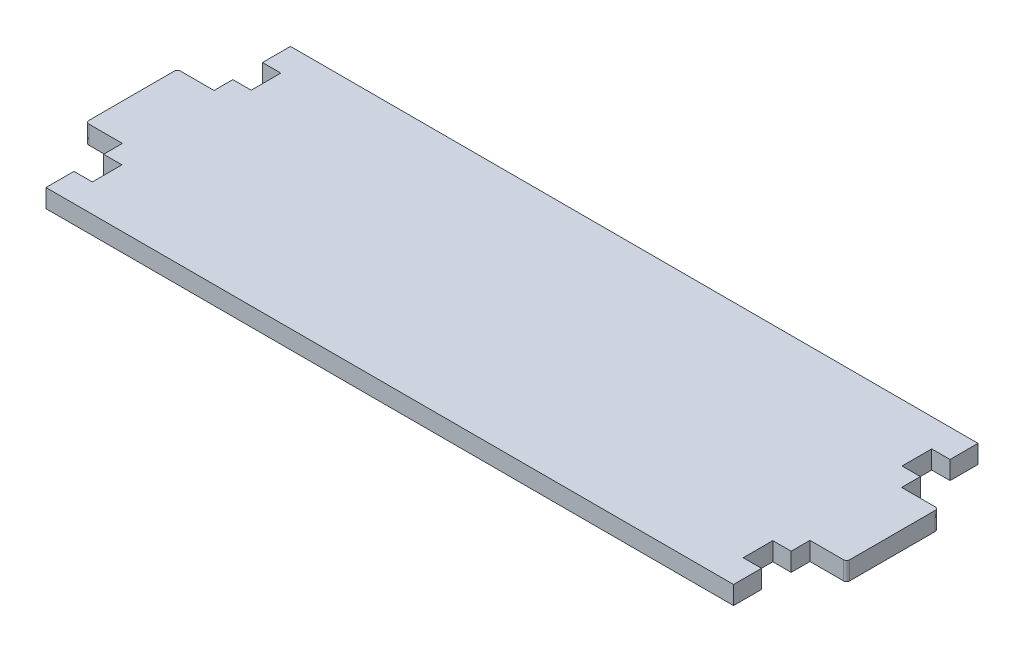
ISO-10303-21;
HEADER;
FILE_DESCRIPTION(('STEP AP214'),'2;1');
FILE_NAME('part.step','',(''),(''),'','','');
FILE_SCHEMA(('AUTOMOTIVE_DESIGN { 1 0 10303 214 1 1 1 1 }'));
ENDSEC;
DATA;
#1=APPLICATION_CONTEXT('core data for automotive mechanical design processes');
#2=APPLICATION_PROTOCOL_DEFINITION('international standard','automotive_design',2000,#1);
#3=PRODUCT_CONTEXT('',#1,'mechanical');
#4=PRODUCT('Part','Part','',(#3));
#5=PRODUCT_RELATED_PRODUCT_CATEGORY('part','',(#4));
#6=PRODUCT_DEFINITION_FORMATION('','',#4);
#7=PRODUCT_DEFINITION_CONTEXT('part definition',#1,'design');
#8=PRODUCT_DEFINITION('design','',#6,#7);
#9=PRODUCT_DEFINITION_SHAPE('','',#8);
#10=(LENGTH_UNIT() NAMED_UNIT(*) SI_UNIT(.MILLI.,.METRE.));
#11=(NAMED_UNIT(*) PLANE_ANGLE_UNIT() SI_UNIT($,.RADIAN.));
#12=(NAMED_UNIT(*) SI_UNIT($,.STERADIAN.) SOLID_ANGLE_UNIT());
#13=UNCERTAINTY_MEASURE_WITH_UNIT(LENGTH_MEASURE(1.E-05),#10,'distance_accuracy_value','');
#14=(GEOMETRIC_REPRESENTATION_CONTEXT(3) GLOBAL_UNCERTAINTY_ASSIGNED_CONTEXT((#13)) GLOBAL_UNIT_ASSIGNED_CONTEXT((#10,
#11,#12)) REPRESENTATION_CONTEXT('',''));
#15=CARTESIAN_POINT('',(0.,0.,0.));
#16=DIRECTION('',(0.,0.,1.));
#17=DIRECTION('',(1.,0.,0.));
#18=AXIS2_PLACEMENT_3D('',#15,#16,#17);
#19=CARTESIAN_POINT('',(0.,3.,10.5750000000001));
#20=DIRECTION('',(0.,0.,1.));
#21=DIRECTION('',(1.,0.,0.));
#22=AXIS2_PLACEMENT_3D('',#19,#20,#21);
#23=PLANE('',#22);
#24=DIRECTION('',(-1.,0.,0.));
#25=VECTOR('',#24,1.);
#26=CARTESIAN_POINT('',(0.,0.,10.5750000000001));
#27=LINE('',#26,#25);
#28=CARTESIAN_POINT('',(-53.25,0.,10.575));
#29=VERTEX_POINT('',#28);
#30=CARTESIAN_POINT('',(-56.25,0.,10.575));
#31=VERTEX_POINT('',#30);
#32=EDGE_CURVE('E260',#29,#31,#27,.T.);
#33=ORIENTED_EDGE('',*,*,#32,.F.);
#34=DIRECTION('',(0.,-1.,0.));
#35=VECTOR('',#34,1.);
#36=CARTESIAN_POINT('',(-53.25,3.,10.575));
#37=LINE('',#36,#35);
#38=CARTESIAN_POINT('',(-53.25,3.,10.575));
#39=VERTEX_POINT('',#38);
#40=EDGE_CURVE('E256',#39,#29,#37,.T.);
#41=ORIENTED_EDGE('',*,*,#40,.F.);
#42=DIRECTION('',(-1.,0.,0.));
#43=VECTOR('',#42,1.);
#44=CARTESIAN_POINT('',(0.,3.,10.5750000000001));
#45=LINE('',#44,#43);
#46=CARTESIAN_POINT('',(-56.25,3.,10.575));
#47=VERTEX_POINT('',#46);
#48=EDGE_CURVE('E258',#39,#47,#45,.T.);
#49=ORIENTED_EDGE('',*,*,#48,.T.);
#50=DIRECTION('',(0.,-1.,0.));
#51=VECTOR('',#50,1.);
#52=CARTESIAN_POINT('',(-56.25,3.,10.575));
#53=LINE('',#52,#51);
#54=EDGE_CURVE('E506',#47,#31,#53,.T.);
#55=ORIENTED_EDGE('',*,*,#54,.T.);
#56=EDGE_LOOP('',(#33,#41,#49,#55));
#57=FACE_BOUND('',#56,.T.);
#58=ADVANCED_FACE('F45',(#57),#23,.T.);
#59=CARTESIAN_POINT('',(-53.25,3.,0.));
#60=DIRECTION('',(-1.,0.,0.));
#61=DIRECTION('',(0.,0.,1.));
#62=AXIS2_PLACEMENT_3D('',#59,#60,#61);
#63=PLANE('',#62);
#64=DIRECTION('',(0.,0.,-1.));
#65=VECTOR('',#64,1.);
#66=CARTESIAN_POINT('',(-53.25,0.,0.));
#67=LINE('',#66,#65);
#68=CARTESIAN_POINT('',(-53.25,0.,15.425));
#69=VERTEX_POINT('',#68);
#70=EDGE_CURVE('E599',#69,#29,#67,.T.);
#71=ORIENTED_EDGE('',*,*,#70,.F.);
#72=DIRECTION('',(0.,-1.,0.));
#73=VECTOR('',#72,1.);
#74=CARTESIAN_POINT('',(-53.25,3.,15.425));
#75=LINE('',#74,#73);
#76=CARTESIAN_POINT('',(-53.25,3.,15.425));
#77=VERTEX_POINT('',#76);
#78=EDGE_CURVE('E266',#77,#69,#75,.T.);
#79=ORIENTED_EDGE('',*,*,#78,.F.);
#80=DIRECTION('',(0.,0.,-1.));
#81=VECTOR('',#80,1.);
#82=CARTESIAN_POINT('',(-53.25,3.,0.));
#83=LINE('',#82,#81);
#84=EDGE_CURVE('E271',#77,#39,#83,.T.);
#85=ORIENTED_EDGE('',*,*,#84,.T.);
#86=ORIENTED_EDGE('',*,*,#40,.T.);
#87=EDGE_LOOP('',(#71,#79,#85,#86));
#88=FACE_BOUND('',#87,.T.);
#89=ADVANCED_FACE('F278',(#88),#63,.T.);
#90=CARTESIAN_POINT('',(0.,3.,15.4250000000001));
#91=DIRECTION('',(0.,0.,1.));
#92=DIRECTION('',(1.,0.,0.));
#93=AXIS2_PLACEMENT_3D('',#90,#91,#92);
#94=PLANE('',#93);
#95=DIRECTION('',(-1.,0.,0.));
#96=VECTOR('',#95,1.);
#97=CARTESIAN_POINT('',(0.,0.,15.4250000000001));
#98=LINE('',#97,#96);
#99=CARTESIAN_POINT('',(-56.25,0.,15.425));
#100=VERTEX_POINT('',#99);
#101=EDGE_CURVE('E595',#69,#100,#98,.T.);
#102=ORIENTED_EDGE('',*,*,#101,.T.);
#103=DIRECTION('',(0.,-1.,0.));
#104=VECTOR('',#103,1.);
#105=CARTESIAN_POINT('',(-56.25,3.,15.425));
#106=LINE('',#105,#104);
#107=CARTESIAN_POINT('',(-56.25,3.,15.425));
#108=VERTEX_POINT('',#107);
#109=EDGE_CURVE('E460',#108,#100,#106,.T.);
#110=ORIENTED_EDGE('',*,*,#109,.F.);
#111=DIRECTION('',(-1.,0.,0.));
#112=VECTOR('',#111,1.);
#113=CARTESIAN_POINT('',(0.,3.,15.4250000000001));
#114=LINE('',#113,#112);
#115=EDGE_CURVE('E281',#77,#108,#114,.T.);
#116=ORIENTED_EDGE('',*,*,#115,.F.);
#117=ORIENTED_EDGE('',*,*,#78,.T.);
#118=EDGE_LOOP('',(#102,#110,#116,#117));
#119=FACE_BOUND('',#118,.T.);
#120=ADVANCED_FACE('F624',(#119),#94,.F.);
#121=CARTESIAN_POINT('',(-56.25,3.,0.));
#122=DIRECTION('',(1.,0.,0.));
#123=DIRECTION('',(0.,0.,-1.));
#124=AXIS2_PLACEMENT_3D('',#121,#122,#123);
#125=PLANE('',#124);
#126=DIRECTION('',(0.,0.,1.));
#127=VECTOR('',#126,1.);
#128=CARTESIAN_POINT('',(-56.25,0.,0.));
#129=LINE('',#128,#127);
#130=CARTESIAN_POINT('',(-56.25,0.,20.));
#131=VERTEX_POINT('',#130);
#132=EDGE_CURVE('E559',#100,#131,#129,.T.);
#133=ORIENTED_EDGE('',*,*,#132,.T.);
#134=DIRECTION('',(0.,-1.,0.));
#135=VECTOR('',#134,1.);
#136=CARTESIAN_POINT('',(-56.25,3.,20.));
#137=LINE('',#136,#135);
#138=CARTESIAN_POINT('',(-56.25,3.,20.));
#139=VERTEX_POINT('',#138);
#140=EDGE_CURVE('E457',#139,#131,#137,.T.);
#141=ORIENTED_EDGE('',*,*,#140,.F.);
#142=DIRECTION('',(0.,0.,1.));
#143=VECTOR('',#142,1.);
#144=CARTESIAN_POINT('',(-56.25,3.,0.));
#145=LINE('',#144,#143);
#146=EDGE_CURVE('E284',#108,#139,#145,.T.);
#147=ORIENTED_EDGE('',*,*,#146,.F.);
#148=ORIENTED_EDGE('',*,*,#109,.T.);
#149=EDGE_LOOP('',(#133,#141,#147,#148));
#150=FACE_BOUND('',#149,.T.);
#151=ADVANCED_FACE('F622',(#150),#125,.F.);
#152=CARTESIAN_POINT('',(0.,3.,20.));
#153=DIRECTION('',(0.,0.,-1.));
#154=DIRECTION('',(-1.,0.,0.));
#155=AXIS2_PLACEMENT_3D('',#152,#153,#154);
#156=PLANE('',#155);
#157=DIRECTION('',(1.,0.,0.));
#158=VECTOR('',#157,1.);
#159=CARTESIAN_POINT('',(0.,0.,20.));
#160=LINE('',#159,#158);
#161=CARTESIAN_POINT('',(56.25,0.,20.));
#162=VERTEX_POINT('',#161);
#163=EDGE_CURVE('E553',#131,#162,#160,.T.);
#164=ORIENTED_EDGE('',*,*,#163,.T.);
#165=DIRECTION('',(0.,-1.,0.));
#166=VECTOR('',#165,1.);
#167=CARTESIAN_POINT('',(56.25,3.,20.));
#168=LINE('',#167,#166);
#169=CARTESIAN_POINT('',(56.25,3.,20.));
#170=VERTEX_POINT('',#169);
#171=EDGE_CURVE('E455',#170,#162,#168,.T.);
#172=ORIENTED_EDGE('',*,*,#171,.F.);
#173=DIRECTION('',(1.,0.,0.));
#174=VECTOR('',#173,1.);
#175=CARTESIAN_POINT('',(0.,3.,20.));
#176=LINE('',#175,#174);
#177=EDGE_CURVE('E299',#139,#170,#176,.T.);
#178=ORIENTED_EDGE('',*,*,#177,.F.);
#179=ORIENTED_EDGE('',*,*,#140,.T.);
#180=EDGE_LOOP('',(#164,#172,#178,#179));
#181=FACE_BOUND('',#180,.T.);
#182=ADVANCED_FACE('F618',(#181),#156,.F.);
#183=CARTESIAN_POINT('',(56.25,3.,0.));
#184=DIRECTION('',(1.,0.,0.));
#185=DIRECTION('',(0.,0.,-1.));
#186=AXIS2_PLACEMENT_3D('',#183,#184,#185);
#187=PLANE('',#186);
#188=DIRECTION('',(0.,0.,1.));
#189=VECTOR('',#188,1.);
#190=CARTESIAN_POINT('',(56.25,0.,0.));
#191=LINE('',#190,#189);
#192=CARTESIAN_POINT('',(56.25,0.,15.425));
#193=VERTEX_POINT('',#192);
#194=EDGE_CURVE('E543',#193,#162,#191,.T.);
#195=ORIENTED_EDGE('',*,*,#194,.F.);
#196=DIRECTION('',(0.,-1.,0.));
#197=VECTOR('',#196,1.);
#198=CARTESIAN_POINT('',(56.25,3.,15.425));
#199=LINE('',#198,#197);
#200=CARTESIAN_POINT('',(56.25,3.,15.425));
#201=VERTEX_POINT('',#200);
#202=EDGE_CURVE('E453',#201,#193,#199,.T.);
#203=ORIENTED_EDGE('',*,*,#202,.F.);
#204=DIRECTION('',(0.,0.,1.));
#205=VECTOR('',#204,1.);
#206=CARTESIAN_POINT('',(56.25,3.,0.));
#207=LINE('',#206,#205);
#208=EDGE_CURVE('E418',#201,#170,#207,.T.);
#209=ORIENTED_EDGE('',*,*,#208,.T.);
#210=ORIENTED_EDGE('',*,*,#171,.T.);
#211=EDGE_LOOP('',(#195,#203,#209,#210));
#212=FACE_BOUND('',#211,.T.);
#213=ADVANCED_FACE('F708',(#212),#187,.T.);
#214=CARTESIAN_POINT('',(0.,3.,15.4250000000002));
#215=DIRECTION('',(0.,0.,-1.));
#216=DIRECTION('',(-1.,0.,0.));
#217=AXIS2_PLACEMENT_3D('',#214,#215,#216);
#218=PLANE('',#217);
#219=DIRECTION('',(1.,0.,0.));
#220=VECTOR('',#219,1.);
#221=CARTESIAN_POINT('',(0.,0.,15.4250000000002));
#222=LINE('',#221,#220);
#223=CARTESIAN_POINT('',(53.25,0.,15.425));
#224=VERTEX_POINT('',#223);
#225=EDGE_CURVE('E552',#224,#193,#222,.T.);
#226=ORIENTED_EDGE('',*,*,#225,.F.);
#227=DIRECTION('',(0.,-1.,0.));
#228=VECTOR('',#227,1.);
#229=CARTESIAN_POINT('',(53.25,3.,15.425));
#230=LINE('',#229,#228);
#231=CARTESIAN_POINT('',(53.25,3.,15.425));
#232=VERTEX_POINT('',#231);
#233=EDGE_CURVE('E451',#232,#224,#230,.T.);
#234=ORIENTED_EDGE('',*,*,#233,.F.);
#235=DIRECTION('',(1.,0.,0.));
#236=VECTOR('',#235,1.);
#237=CARTESIAN_POINT('',(0.,3.,15.4250000000002));
#238=LINE('',#237,#236);
#239=EDGE_CURVE('E671',#232,#201,#238,.T.);
#240=ORIENTED_EDGE('',*,*,#239,.T.);
#241=ORIENTED_EDGE('',*,*,#202,.T.);
#242=EDGE_LOOP('',(#226,#234,#240,#241));
#243=FACE_BOUND('',#242,.T.);
#244=ADVANCED_FACE('F715',(#243),#218,.T.);
#245=CARTESIAN_POINT('',(53.25,3.,0.));
#246=DIRECTION('',(-1.,0.,0.));
#247=DIRECTION('',(0.,0.,1.));
#248=AXIS2_PLACEMENT_3D('',#245,#246,#247);
#249=PLANE('',#248);
#250=DIRECTION('',(0.,0.,-1.));
#251=VECTOR('',#250,1.);
#252=CARTESIAN_POINT('',(53.25,0.,0.));
#253=LINE('',#252,#251);
#254=CARTESIAN_POINT('',(53.25,0.,10.575));
#255=VERTEX_POINT('',#254);
#256=EDGE_CURVE('E557',#224,#255,#253,.T.);
#257=ORIENTED_EDGE('',*,*,#256,.T.);
#258=DIRECTION('',(0.,-1.,0.));
#259=VECTOR('',#258,1.);
#260=CARTESIAN_POINT('',(53.25,3.,10.575));
#261=LINE('',#260,#259);
#262=CARTESIAN_POINT('',(53.25,3.,10.575));
#263=VERTEX_POINT('',#262);
#264=EDGE_CURVE('E448',#263,#255,#261,.T.);
#265=ORIENTED_EDGE('',*,*,#264,.F.);
#266=DIRECTION('',(0.,0.,-1.));
#267=VECTOR('',#266,1.);
#268=CARTESIAN_POINT('',(53.25,3.,0.));
#269=LINE('',#268,#267);
#270=EDGE_CURVE('E668',#232,#263,#269,.T.);
#271=ORIENTED_EDGE('',*,*,#270,.F.);
#272=ORIENTED_EDGE('',*,*,#233,.T.);
#273=EDGE_LOOP('',(#257,#265,#271,#272));
#274=FACE_BOUND('',#273,.T.);
#275=ADVANCED_FACE('F693',(#274),#249,.F.);
#276=CARTESIAN_POINT('',(0.,3.,10.5750000000001));
#277=DIRECTION('',(0.,0.,-1.));
#278=DIRECTION('',(-1.,0.,0.));
#279=AXIS2_PLACEMENT_3D('',#276,#277,#278);
#280=PLANE('',#279);
#281=DIRECTION('',(1.,0.,0.));
#282=VECTOR('',#281,1.);
#283=CARTESIAN_POINT('',(0.,0.,10.5750000000001));
#284=LINE('',#283,#282);
#285=CARTESIAN_POINT('',(56.25,0.,10.575));
#286=VERTEX_POINT('',#285);
#287=EDGE_CURVE('E562',#255,#286,#284,.T.);
#288=ORIENTED_EDGE('',*,*,#287,.T.);
#289=DIRECTION('',(0.,-1.,0.));
#290=VECTOR('',#289,1.);
#291=CARTESIAN_POINT('',(56.25,3.,10.575));
#292=LINE('',#291,#290);
#293=CARTESIAN_POINT('',(56.25,3.,10.575));
#294=VERTEX_POINT('',#293);
#295=EDGE_CURVE('E446',#294,#286,#292,.T.);
#296=ORIENTED_EDGE('',*,*,#295,.F.);
#297=DIRECTION('',(1.,0.,0.));
#298=VECTOR('',#297,1.);
#299=CARTESIAN_POINT('',(0.,3.,10.5750000000001));
#300=LINE('',#299,#298);
#301=EDGE_CURVE('E663',#263,#294,#300,.T.);
#302=ORIENTED_EDGE('',*,*,#301,.F.);
#303=ORIENTED_EDGE('',*,*,#264,.T.);
#304=EDGE_LOOP('',(#288,#296,#302,#303));
#305=FACE_BOUND('',#304,.T.);
#306=ADVANCED_FACE('F695',(#305),#280,.F.);
#307=CARTESIAN_POINT('',(56.25,0.,7.5));
#308=VERTEX_POINT('',#307);
#309=EDGE_CURVE('E550',#308,#286,#191,.T.);
#310=ORIENTED_EDGE('',*,*,#309,.F.);
#311=DIRECTION('',(0.,-1.,0.));
#312=VECTOR('',#311,1.);
#313=CARTESIAN_POINT('',(56.25,3.,7.5));
#314=LINE('',#313,#312);
#315=CARTESIAN_POINT('',(56.25,3.,7.5));
#316=VERTEX_POINT('',#315);
#317=EDGE_CURVE('E444',#316,#308,#314,.T.);
#318=ORIENTED_EDGE('',*,*,#317,.F.);
#319=EDGE_CURVE('E658',#316,#294,#207,.T.);
#320=ORIENTED_EDGE('',*,*,#319,.T.);
#321=ORIENTED_EDGE('',*,*,#295,.T.);
#322=EDGE_LOOP('',(#310,#318,#320,#321));
#323=FACE_BOUND('',#322,.T.);
#324=ADVANCED_FACE('F696',(#323),#187,.T.);
#325=CARTESIAN_POINT('',(0.,3.,7.50000000000001));
#326=DIRECTION('',(0.,0.,-1.));
#327=DIRECTION('',(-1.,0.,0.));
#328=AXIS2_PLACEMENT_3D('',#325,#326,#327);
#329=PLANE('',#328);
#330=DIRECTION('',(1.,0.,0.));
#331=VECTOR('',#330,1.);
#332=CARTESIAN_POINT('',(0.,0.,7.50000000000001));
#333=LINE('',#332,#331);
#334=CARTESIAN_POINT('',(61.75,0.,7.5));
#335=VERTEX_POINT('',#334);
#336=EDGE_CURVE('E561',#308,#335,#333,.T.);
#337=ORIENTED_EDGE('',*,*,#336,.T.);
#338=DIRECTION('',(0.,-1.,0.));
#339=VECTOR('',#338,1.);
#340=CARTESIAN_POINT('',(61.75,3.,7.5));
#341=LINE('',#340,#339);
#342=CARTESIAN_POINT('',(61.75,3.,7.5));
#343=VERTEX_POINT('',#342);
#344=EDGE_CURVE('E12',#335,#343,#341,.F.);
#345=ORIENTED_EDGE('',*,*,#344,.T.);
#346=DIRECTION('',(1.,0.,0.));
#347=VECTOR('',#346,1.);
#348=CARTESIAN_POINT('',(0.,3.,7.50000000000001));
#349=LINE('',#348,#347);
#350=EDGE_CURVE('E373',#316,#343,#349,.T.);
#351=ORIENTED_EDGE('',*,*,#350,.F.);
#352=ORIENTED_EDGE('',*,*,#317,.T.);
#353=EDGE_LOOP('',(#337,#345,#351,#352));
#354=FACE_BOUND('',#353,.T.);
#355=ADVANCED_FACE('F699',(#354),#329,.F.);
#356=CARTESIAN_POINT('',(62.25,3.,0.));
#357=DIRECTION('',(1.,0.,0.));
#358=DIRECTION('',(0.,0.,-1.));
#359=AXIS2_PLACEMENT_3D('',#356,#357,#358);
#360=PLANE('',#359);
#361=DIRECTION('',(0.,0.,1.));
#362=VECTOR('',#361,1.);
#363=CARTESIAN_POINT('',(62.25,0.,0.));
#364=LINE('',#363,#362);
#365=CARTESIAN_POINT('',(62.25,0.,-7.));
#366=VERTEX_POINT('',#365);
#367=CARTESIAN_POINT('',(62.25,0.,7.));
#368=VERTEX_POINT('',#367);
#369=EDGE_CURVE('E366',#366,#368,#364,.T.);
#370=ORIENTED_EDGE('',*,*,#369,.F.);
#371=DIRECTION('',(0.,-1.,0.));
#372=VECTOR('',#371,1.);
#373=CARTESIAN_POINT('',(62.25,3.,-7.));
#374=LINE('',#373,#372);
#375=CARTESIAN_POINT('',(62.25,3.,-7.));
#376=VERTEX_POINT('',#375);
#377=EDGE_CURVE('E53',#366,#376,#374,.F.);
#378=ORIENTED_EDGE('',*,*,#377,.T.);
#379=DIRECTION('',(0.,0.,1.));
#380=VECTOR('',#379,1.);
#381=CARTESIAN_POINT('',(62.25,3.,0.));
#382=LINE('',#381,#380);
#383=CARTESIAN_POINT('',(62.25,3.,7.));
#384=VERTEX_POINT('',#383);
#385=EDGE_CURVE('E363',#376,#384,#382,.T.);
#386=ORIENTED_EDGE('',*,*,#385,.T.);
#387=DIRECTION('',(0.,-1.,0.));
#388=VECTOR('',#387,1.);
#389=CARTESIAN_POINT('',(62.25,0.,7.));
#390=LINE('',#389,#388);
#391=EDGE_CURVE('E356',#384,#368,#390,.T.);
#392=ORIENTED_EDGE('',*,*,#391,.T.);
#393=EDGE_LOOP('',(#370,#378,#386,#392));
#394=FACE_BOUND('',#393,.T.);
#395=ADVANCED_FACE('F362',(#394),#360,.T.);
#396=CARTESIAN_POINT('',(0.,3.,-7.5));
#397=DIRECTION('',(0.,0.,-1.));
#398=DIRECTION('',(-1.,0.,0.));
#399=AXIS2_PLACEMENT_3D('',#396,#397,#398);
#400=PLANE('',#399);
#401=DIRECTION('',(1.,0.,0.));
#402=VECTOR('',#401,1.);
#403=CARTESIAN_POINT('',(0.,3.,-7.5));
#404=LINE('',#403,#402);
#405=CARTESIAN_POINT('',(56.25,3.,-7.5));
#406=VERTEX_POINT('',#405);
#407=CARTESIAN_POINT('',(61.75,3.,-7.5));
#408=VERTEX_POINT('',#407);
#409=EDGE_CURVE('E372',#406,#408,#404,.T.);
#410=ORIENTED_EDGE('',*,*,#409,.T.);
#411=DIRECTION('',(0.,-1.,0.));
#412=VECTOR('',#411,1.);
#413=CARTESIAN_POINT('',(61.75,3.,-7.5));
#414=LINE('',#413,#412);
#415=CARTESIAN_POINT('',(61.75,0.,-7.5));
#416=VERTEX_POINT('',#415);
#417=EDGE_CURVE('E353',#408,#416,#414,.T.);
#418=ORIENTED_EDGE('',*,*,#417,.T.);
#419=DIRECTION('',(1.,0.,0.));
#420=VECTOR('',#419,1.);
#421=CARTESIAN_POINT('',(0.,0.,-7.5));
#422=LINE('',#421,#420);
#423=CARTESIAN_POINT('',(56.25,0.,-7.5));
#424=VERTEX_POINT('',#423);
#425=EDGE_CURVE('E549',#424,#416,#422,.T.);
#426=ORIENTED_EDGE('',*,*,#425,.F.);
#427=DIRECTION('',(0.,-1.,0.));
#428=VECTOR('',#427,1.);
#429=CARTESIAN_POINT('',(56.25,3.,-7.5));
#430=LINE('',#429,#428);
#431=EDGE_CURVE('E437',#406,#424,#430,.T.);
#432=ORIENTED_EDGE('',*,*,#431,.F.);
#433=EDGE_LOOP('',(#410,#418,#426,#432));
#434=FACE_BOUND('',#433,.T.);
#435=ADVANCED_FACE('F654',(#434),#400,.T.);
#436=CARTESIAN_POINT('',(56.25,0.,-10.575));
#437=VERTEX_POINT('',#436);
#438=EDGE_CURVE('E542',#437,#424,#191,.T.);
#439=ORIENTED_EDGE('',*,*,#438,.F.);
#440=DIRECTION('',(0.,-1.,0.));
#441=VECTOR('',#440,1.);
#442=CARTESIAN_POINT('',(56.25,3.,-10.575));
#443=LINE('',#442,#441);
#444=CARTESIAN_POINT('',(56.25,3.,-10.575));
#445=VERTEX_POINT('',#444);
#446=EDGE_CURVE('E431',#445,#437,#443,.T.);
#447=ORIENTED_EDGE('',*,*,#446,.F.);
#448=EDGE_CURVE('E395',#445,#406,#207,.T.);
#449=ORIENTED_EDGE('',*,*,#448,.T.);
#450=ORIENTED_EDGE('',*,*,#431,.T.);
#451=EDGE_LOOP('',(#439,#447,#449,#450));
#452=FACE_BOUND('',#451,.T.);
#453=ADVANCED_FACE('F656',(#452),#187,.T.);
#454=CARTESIAN_POINT('',(0.,3.,-10.5750000000001));
#455=DIRECTION('',(0.,0.,-1.));
#456=DIRECTION('',(-1.,0.,0.));
#457=AXIS2_PLACEMENT_3D('',#454,#455,#456);
#458=PLANE('',#457);
#459=DIRECTION('',(1.,0.,0.));
#460=VECTOR('',#459,1.);
#461=CARTESIAN_POINT('',(0.,0.,-10.5750000000001));
#462=LINE('',#461,#460);
#463=CARTESIAN_POINT('',(53.25,0.,-10.575));
#464=VERTEX_POINT('',#463);
#465=EDGE_CURVE('E434',#464,#437,#462,.T.);
#466=ORIENTED_EDGE('',*,*,#465,.F.);
#467=DIRECTION('',(0.,-1.,0.));
#468=VECTOR('',#467,1.);
#469=CARTESIAN_POINT('',(53.25,3.,-10.575));
#470=LINE('',#469,#468);
#471=CARTESIAN_POINT('',(53.25,3.,-10.575));
#472=VERTEX_POINT('',#471);
#473=EDGE_CURVE('E423',#472,#464,#470,.T.);
#474=ORIENTED_EDGE('',*,*,#473,.F.);
#475=DIRECTION('',(1.,0.,0.));
#476=VECTOR('',#475,1.);
#477=CARTESIAN_POINT('',(0.,3.,-10.5750000000001));
#478=LINE('',#477,#476);
#479=EDGE_CURVE('E398',#472,#445,#478,.T.);
#480=ORIENTED_EDGE('',*,*,#479,.T.);
#481=ORIENTED_EDGE('',*,*,#446,.T.);
#482=EDGE_LOOP('',(#466,#474,#480,#481));
#483=FACE_BOUND('',#482,.T.);
#484=ADVANCED_FACE('F430',(#483),#458,.T.);
#485=CARTESIAN_POINT('',(53.25,3.,0.));
#486=DIRECTION('',(1.,0.,0.));
#487=DIRECTION('',(0.,0.,-1.));
#488=AXIS2_PLACEMENT_3D('',#485,#486,#487);
#489=PLANE('',#488);
#490=DIRECTION('',(0.,0.,1.));
#491=VECTOR('',#490,1.);
#492=CARTESIAN_POINT('',(53.25,0.,0.));
#493=LINE('',#492,#491);
#494=CARTESIAN_POINT('',(53.25,0.,-15.425));
#495=VERTEX_POINT('',#494);
#496=EDGE_CURVE('E536',#495,#464,#493,.T.);
#497=ORIENTED_EDGE('',*,*,#496,.F.);
#498=DIRECTION('',(0.,-1.,0.));
#499=VECTOR('',#498,1.);
#500=CARTESIAN_POINT('',(53.25,3.,-15.425));
#501=LINE('',#500,#499);
#502=CARTESIAN_POINT('',(53.25,3.,-15.425));
#503=VERTEX_POINT('',#502);
#504=EDGE_CURVE('E425',#503,#495,#501,.T.);
#505=ORIENTED_EDGE('',*,*,#504,.F.);
#506=DIRECTION('',(0.,0.,1.));
#507=VECTOR('',#506,1.);
#508=CARTESIAN_POINT('',(53.25,3.,0.));
#509=LINE('',#508,#507);
#510=EDGE_CURVE('E403',#503,#472,#509,.T.);
#511=ORIENTED_EDGE('',*,*,#510,.T.);
#512=ORIENTED_EDGE('',*,*,#473,.T.);
#513=EDGE_LOOP('',(#497,#505,#511,#512));
#514=FACE_BOUND('',#513,.T.);
#515=ADVANCED_FACE('F422',(#514),#489,.T.);
#516=CARTESIAN_POINT('',(0.,3.,-15.4250000000001));
#517=DIRECTION('',(0.,0.,-1.));
#518=DIRECTION('',(-1.,0.,0.));
#519=AXIS2_PLACEMENT_3D('',#516,#517,#518);
#520=PLANE('',#519);
#521=DIRECTION('',(1.,0.,0.));
#522=VECTOR('',#521,1.);
#523=CARTESIAN_POINT('',(0.,0.,-15.4250000000001));
#524=LINE('',#523,#522);
#525=CARTESIAN_POINT('',(56.25,0.,-15.425));
#526=VERTEX_POINT('',#525);
#527=EDGE_CURVE('E534',#495,#526,#524,.T.);
#528=ORIENTED_EDGE('',*,*,#527,.T.);
#529=DIRECTION('',(0.,-1.,0.));
#530=VECTOR('',#529,1.);
#531=CARTESIAN_POINT('',(56.25,3.,-15.425));
#532=LINE('',#531,#530);
#533=CARTESIAN_POINT('',(56.25,3.,-15.425));
#534=VERTEX_POINT('',#533);
#535=EDGE_CURVE('E439',#534,#526,#532,.T.);
#536=ORIENTED_EDGE('',*,*,#535,.F.);
#537=DIRECTION('',(1.,0.,0.));
#538=VECTOR('',#537,1.);
#539=CARTESIAN_POINT('',(0.,3.,-15.4250000000001));
#540=LINE('',#539,#538);
#541=EDGE_CURVE('E407',#503,#534,#540,.T.);
#542=ORIENTED_EDGE('',*,*,#541,.F.);
#543=ORIENTED_EDGE('',*,*,#504,.T.);
#544=EDGE_LOOP('',(#528,#536,#542,#543));
#545=FACE_BOUND('',#544,.T.);
#546=ADVANCED_FACE('F535',(#545),#520,.F.);
#547=CARTESIAN_POINT('',(56.25,0.,-20.));
#548=VERTEX_POINT('',#547);
#549=EDGE_CURVE('E530',#548,#526,#191,.T.);
#550=ORIENTED_EDGE('',*,*,#549,.F.);
#551=DIRECTION('',(0.,-1.,0.));
#552=VECTOR('',#551,1.);
#553=CARTESIAN_POINT('',(56.25,3.,-20.));
#554=LINE('',#553,#552);
#555=CARTESIAN_POINT('',(56.25,3.,-20.));
#556=VERTEX_POINT('',#555);
#557=EDGE_CURVE('E524',#556,#548,#554,.T.);
#558=ORIENTED_EDGE('',*,*,#557,.F.);
#559=EDGE_CURVE('E410',#556,#534,#207,.T.);
#560=ORIENTED_EDGE('',*,*,#559,.T.);
#561=ORIENTED_EDGE('',*,*,#535,.T.);
#562=EDGE_LOOP('',(#550,#558,#560,#561));
#563=FACE_BOUND('',#562,.T.);
#564=ADVANCED_FACE('F528',(#563),#187,.T.);
#565=CARTESIAN_POINT('',(0.,3.,-20.));
#566=DIRECTION('',(0.,0.,-1.));
#567=DIRECTION('',(-1.,0.,0.));
#568=AXIS2_PLACEMENT_3D('',#565,#566,#567);
#569=PLANE('',#568);
#570=DIRECTION('',(1.,0.,0.));
#571=VECTOR('',#570,1.);
#572=CARTESIAN_POINT('',(0.,0.,-20.));
#573=LINE('',#572,#571);
#574=CARTESIAN_POINT('',(-56.25,0.,-20.));
#575=VERTEX_POINT('',#574);
#576=EDGE_CURVE('E540',#575,#548,#573,.T.);
#577=ORIENTED_EDGE('',*,*,#576,.F.);
#578=DIRECTION('',(0.,-1.,0.));
#579=VECTOR('',#578,1.);
#580=CARTESIAN_POINT('',(-56.25,3.,-20.));
#581=LINE('',#580,#579);
#582=CARTESIAN_POINT('',(-56.25,3.,-20.));
#583=VERTEX_POINT('',#582);
#584=EDGE_CURVE('E522',#583,#575,#581,.T.);
#585=ORIENTED_EDGE('',*,*,#584,.F.);
#586=DIRECTION('',(1.,0.,0.));
#587=VECTOR('',#586,1.);
#588=CARTESIAN_POINT('',(0.,3.,-20.));
#589=LINE('',#588,#587);
#590=EDGE_CURVE('E320',#583,#556,#589,.T.);
#591=ORIENTED_EDGE('',*,*,#590,.T.);
#592=ORIENTED_EDGE('',*,*,#557,.T.);
#593=EDGE_LOOP('',(#577,#585,#591,#592));
#594=FACE_BOUND('',#593,.T.);
#595=ADVANCED_FACE('F726',(#594),#569,.T.);
#596=CARTESIAN_POINT('',(-56.25,0.,-15.425));
#597=VERTEX_POINT('',#596);
#598=EDGE_CURVE('E544',#575,#597,#129,.T.);
#599=ORIENTED_EDGE('',*,*,#598,.T.);
#600=DIRECTION('',(0.,-1.,0.));
#601=VECTOR('',#600,1.);
#602=CARTESIAN_POINT('',(-56.25,3.,-15.425));
#603=LINE('',#602,#601);
#604=CARTESIAN_POINT('',(-56.25,3.,-15.425));
#605=VERTEX_POINT('',#604);
#606=EDGE_CURVE('E520',#605,#597,#603,.T.);
#607=ORIENTED_EDGE('',*,*,#606,.F.);
#608=EDGE_CURVE('E300',#583,#605,#145,.T.);
#609=ORIENTED_EDGE('',*,*,#608,.F.);
#610=ORIENTED_EDGE('',*,*,#584,.T.);
#611=EDGE_LOOP('',(#599,#607,#609,#610));
#612=FACE_BOUND('',#611,.T.);
#613=ADVANCED_FACE('F632',(#612),#125,.F.);
#614=CARTESIAN_POINT('',(0.,3.,-15.4250000000001));
#615=DIRECTION('',(0.,0.,1.));
#616=DIRECTION('',(1.,0.,0.));
#617=AXIS2_PLACEMENT_3D('',#614,#615,#616);
#618=PLANE('',#617);
#619=DIRECTION('',(-1.,0.,0.));
#620=VECTOR('',#619,1.);
#621=CARTESIAN_POINT('',(0.,0.,-15.4250000000001));
#622=LINE('',#621,#620);
#623=CARTESIAN_POINT('',(-53.25,0.,-15.425));
#624=VERTEX_POINT('',#623);
#625=EDGE_CURVE('E579',#624,#597,#622,.T.);
#626=ORIENTED_EDGE('',*,*,#625,.F.);
#627=DIRECTION('',(0.,-1.,0.));
#628=VECTOR('',#627,1.);
#629=CARTESIAN_POINT('',(-53.25,3.,-15.425));
#630=LINE('',#629,#628);
#631=CARTESIAN_POINT('',(-53.25,3.,-15.425));
#632=VERTEX_POINT('',#631);
#633=EDGE_CURVE('E518',#632,#624,#630,.T.);
#634=ORIENTED_EDGE('',*,*,#633,.F.);
#635=DIRECTION('',(-1.,0.,0.));
#636=VECTOR('',#635,1.);
#637=CARTESIAN_POINT('',(0.,3.,-15.4250000000001));
#638=LINE('',#637,#636);
#639=EDGE_CURVE('E315',#632,#605,#638,.T.);
#640=ORIENTED_EDGE('',*,*,#639,.T.);
#641=ORIENTED_EDGE('',*,*,#606,.T.);
#642=EDGE_LOOP('',(#626,#634,#640,#641));
#643=FACE_BOUND('',#642,.T.);
#644=ADVANCED_FACE('F769',(#643),#618,.T.);
#645=CARTESIAN_POINT('',(-53.25,3.,0.));
#646=DIRECTION('',(1.,0.,0.));
#647=DIRECTION('',(0.,0.,-1.));
#648=AXIS2_PLACEMENT_3D('',#645,#646,#647);
#649=PLANE('',#648);
#650=DIRECTION('',(0.,0.,1.));
#651=VECTOR('',#650,1.);
#652=CARTESIAN_POINT('',(-53.25,0.,0.));
#653=LINE('',#652,#651);
#654=CARTESIAN_POINT('',(-53.25,0.,-10.575));
#655=VERTEX_POINT('',#654);
#656=EDGE_CURVE('E582',#624,#655,#653,.T.);
#657=ORIENTED_EDGE('',*,*,#656,.T.);
#658=DIRECTION('',(0.,-1.,0.));
#659=VECTOR('',#658,1.);
#660=CARTESIAN_POINT('',(-53.25,3.,-10.575));
#661=LINE('',#660,#659);
#662=CARTESIAN_POINT('',(-53.25,3.,-10.575));
#663=VERTEX_POINT('',#662);
#664=EDGE_CURVE('E515',#663,#655,#661,.T.);
#665=ORIENTED_EDGE('',*,*,#664,.F.);
#666=DIRECTION('',(0.,0.,1.));
#667=VECTOR('',#666,1.);
#668=CARTESIAN_POINT('',(-53.25,3.,0.));
#669=LINE('',#668,#667);
#670=EDGE_CURVE('E319',#632,#663,#669,.T.);
#671=ORIENTED_EDGE('',*,*,#670,.F.);
#672=ORIENTED_EDGE('',*,*,#633,.T.);
#673=EDGE_LOOP('',(#657,#665,#671,#672));
#674=FACE_BOUND('',#673,.T.);
#675=ADVANCED_FACE('F779',(#674),#649,.F.);
#676=CARTESIAN_POINT('',(0.,3.,-10.5750000000001));
#677=DIRECTION('',(0.,0.,1.));
#678=DIRECTION('',(1.,0.,0.));
#679=AXIS2_PLACEMENT_3D('',#676,#677,#678);
#680=PLANE('',#679);
#681=DIRECTION('',(-1.,0.,0.));
#682=VECTOR('',#681,1.);
#683=CARTESIAN_POINT('',(0.,0.,-10.5750000000001));
#684=LINE('',#683,#682);
#685=CARTESIAN_POINT('',(-56.25,0.,-10.575));
#686=VERTEX_POINT('',#685);
#687=EDGE_CURVE('E583',#655,#686,#684,.T.);
#688=ORIENTED_EDGE('',*,*,#687,.T.);
#689=DIRECTION('',(0.,-1.,0.));
#690=VECTOR('',#689,1.);
#691=CARTESIAN_POINT('',(-56.25,3.,-10.575));
#692=LINE('',#691,#690);
#693=CARTESIAN_POINT('',(-56.25,3.,-10.575));
#694=VERTEX_POINT('',#693);
#695=EDGE_CURVE('E512',#694,#686,#692,.T.);
#696=ORIENTED_EDGE('',*,*,#695,.F.);
#697=DIRECTION('',(-1.,0.,0.));
#698=VECTOR('',#697,1.);
#699=CARTESIAN_POINT('',(0.,3.,-10.5750000000001));
#700=LINE('',#699,#698);
#701=EDGE_CURVE('E326',#663,#694,#700,.T.);
#702=ORIENTED_EDGE('',*,*,#701,.F.);
#703=ORIENTED_EDGE('',*,*,#664,.T.);
#704=EDGE_LOOP('',(#688,#696,#702,#703));
#705=FACE_BOUND('',#704,.T.);
#706=ADVANCED_FACE('F789',(#705),#680,.F.);
#707=CARTESIAN_POINT('',(-56.25,0.,-7.5));
#708=VERTEX_POINT('',#707);
#709=EDGE_CURVE('E502',#686,#708,#129,.T.);
#710=ORIENTED_EDGE('',*,*,#709,.T.);
#711=DIRECTION('',(0.,-1.,0.));
#712=VECTOR('',#711,1.);
#713=CARTESIAN_POINT('',(-56.25,3.,-7.5));
#714=LINE('',#713,#712);
#715=CARTESIAN_POINT('',(-56.25,3.,-7.5));
#716=VERTEX_POINT('',#715);
#717=EDGE_CURVE('E510',#716,#708,#714,.T.);
#718=ORIENTED_EDGE('',*,*,#717,.F.);
#719=EDGE_CURVE('E330',#694,#716,#145,.T.);
#720=ORIENTED_EDGE('',*,*,#719,.F.);
#721=ORIENTED_EDGE('',*,*,#695,.T.);
#722=EDGE_LOOP('',(#710,#718,#720,#721));
#723=FACE_BOUND('',#722,.T.);
#724=ADVANCED_FACE('F771',(#723),#125,.F.);
#725=CARTESIAN_POINT('',(0.,3.,-7.5));
#726=DIRECTION('',(0.,0.,1.));
#727=DIRECTION('',(1.,0.,0.));
#728=AXIS2_PLACEMENT_3D('',#725,#726,#727);
#729=PLANE('',#728);
#730=DIRECTION('',(-1.,0.,0.));
#731=VECTOR('',#730,1.);
#732=CARTESIAN_POINT('',(0.,0.,-7.5));
#733=LINE('',#732,#731);
#734=CARTESIAN_POINT('',(-61.75,0.,-7.5));
#735=VERTEX_POINT('',#734);
#736=EDGE_CURVE('E482',#708,#735,#733,.T.);
#737=ORIENTED_EDGE('',*,*,#736,.T.);
#738=DIRECTION('',(0.,-1.,0.));
#739=VECTOR('',#738,1.);
#740=CARTESIAN_POINT('',(-61.75,3.,-7.5));
#741=LINE('',#740,#739);
#742=CARTESIAN_POINT('',(-61.75,3.,-7.5));
#743=VERTEX_POINT('',#742);
#744=EDGE_CURVE('E381',#735,#743,#741,.F.);
#745=ORIENTED_EDGE('',*,*,#744,.T.);
#746=DIRECTION('',(-1.,0.,0.));
#747=VECTOR('',#746,1.);
#748=CARTESIAN_POINT('',(0.,3.,-7.5));
#749=LINE('',#748,#747);
#750=EDGE_CURVE('E331',#716,#743,#749,.T.);
#751=ORIENTED_EDGE('',*,*,#750,.F.);
#752=ORIENTED_EDGE('',*,*,#717,.T.);
#753=EDGE_LOOP('',(#737,#745,#751,#752));
#754=FACE_BOUND('',#753,.T.);
#755=ADVANCED_FACE('F479',(#754),#729,.F.);
#756=CARTESIAN_POINT('',(-62.25,3.,0.));
#757=DIRECTION('',(1.,0.,0.));
#758=DIRECTION('',(0.,0.,-1.));
#759=AXIS2_PLACEMENT_3D('',#756,#757,#758);
#760=PLANE('',#759);
#761=DIRECTION('',(0.,0.,1.));
#762=VECTOR('',#761,1.);
#763=CARTESIAN_POINT('',(-62.25,3.,0.));
#764=LINE('',#763,#762);
#765=CARTESIAN_POINT('',(-62.25,3.,-7.));
#766=VERTEX_POINT('',#765);
#767=CARTESIAN_POINT('',(-62.25,3.,7.));
#768=VERTEX_POINT('',#767);
#769=EDGE_CURVE('E335',#766,#768,#764,.T.);
#770=ORIENTED_EDGE('',*,*,#769,.F.);
#771=DIRECTION('',(0.,-1.,0.));
#772=VECTOR('',#771,1.);
#773=CARTESIAN_POINT('',(-62.25,3.,-7.));
#774=LINE('',#773,#772);
#775=CARTESIAN_POINT('',(-62.25,0.,-7.));
#776=VERTEX_POINT('',#775);
#777=EDGE_CURVE('E465',#766,#776,#774,.T.);
#778=ORIENTED_EDGE('',*,*,#777,.T.);
#779=DIRECTION('',(0.,0.,1.));
#780=VECTOR('',#779,1.);
#781=CARTESIAN_POINT('',(-62.25,0.,0.));
#782=LINE('',#781,#780);
#783=CARTESIAN_POINT('',(-62.25,0.,7.));
#784=VERTEX_POINT('',#783);
#785=EDGE_CURVE('E494',#776,#784,#782,.T.);
#786=ORIENTED_EDGE('',*,*,#785,.T.);
#787=DIRECTION('',(0.,-1.,0.));
#788=VECTOR('',#787,1.);
#789=CARTESIAN_POINT('',(-62.25,3.,7.));
#790=LINE('',#789,#788);
#791=EDGE_CURVE('E265',#784,#768,#790,.F.);
#792=ORIENTED_EDGE('',*,*,#791,.T.);
#793=EDGE_LOOP('',(#770,#778,#786,#792));
#794=FACE_BOUND('',#793,.T.);
#795=ADVANCED_FACE('F493',(#794),#760,.F.);
#796=CARTESIAN_POINT('',(0.,3.,7.50000000000001));
#797=DIRECTION('',(0.,0.,1.));
#798=DIRECTION('',(1.,0.,0.));
#799=AXIS2_PLACEMENT_3D('',#796,#797,#798);
#800=PLANE('',#799);
#801=DIRECTION('',(-1.,0.,0.));
#802=VECTOR('',#801,1.);
#803=CARTESIAN_POINT('',(0.,3.,7.50000000000001));
#804=LINE('',#803,#802);
#805=CARTESIAN_POINT('',(-56.25,3.,7.5));
#806=VERTEX_POINT('',#805);
#807=CARTESIAN_POINT('',(-61.75,3.,7.5));
#808=VERTEX_POINT('',#807);
#809=EDGE_CURVE('E605',#806,#808,#804,.T.);
#810=ORIENTED_EDGE('',*,*,#809,.T.);
#811=DIRECTION('',(0.,-1.,0.));
#812=VECTOR('',#811,1.);
#813=CARTESIAN_POINT('',(-61.75,0.,7.5));
#814=LINE('',#813,#812);
#815=CARTESIAN_POINT('',(-61.75,0.,7.5));
#816=VERTEX_POINT('',#815);
#817=EDGE_CURVE('E348',#808,#816,#814,.T.);
#818=ORIENTED_EDGE('',*,*,#817,.T.);
#819=DIRECTION('',(-1.,0.,0.));
#820=VECTOR('',#819,1.);
#821=CARTESIAN_POINT('',(0.,0.,7.50000000000001));
#822=LINE('',#821,#820);
#823=CARTESIAN_POINT('',(-56.25,0.,7.5));
#824=VERTEX_POINT('',#823);
#825=EDGE_CURVE('E499',#824,#816,#822,.T.);
#826=ORIENTED_EDGE('',*,*,#825,.F.);
#827=DIRECTION('',(0.,-1.,0.));
#828=VECTOR('',#827,1.);
#829=CARTESIAN_POINT('',(-56.25,3.,7.5));
#830=LINE('',#829,#828);
#831=EDGE_CURVE('E508',#806,#824,#830,.T.);
#832=ORIENTED_EDGE('',*,*,#831,.F.);
#833=EDGE_LOOP('',(#810,#818,#826,#832));
#834=FACE_BOUND('',#833,.T.);
#835=ADVANCED_FACE('F615',(#834),#800,.T.);
#836=EDGE_CURVE('E276',#824,#31,#129,.T.);
#837=ORIENTED_EDGE('',*,*,#836,.T.);
#838=ORIENTED_EDGE('',*,*,#54,.F.);
#839=EDGE_CURVE('E273',#806,#47,#145,.T.);
#840=ORIENTED_EDGE('',*,*,#839,.F.);
#841=ORIENTED_EDGE('',*,*,#831,.T.);
#842=EDGE_LOOP('',(#837,#838,#840,#841));
#843=FACE_BOUND('',#842,.T.);
#844=ADVANCED_FACE('F633',(#843),#125,.F.);
#845=CARTESIAN_POINT('',(0.,3.,0.));
#846=DIRECTION('',(0.,1.,0.));
#847=DIRECTION('',(0.,0.,1.));
#848=AXIS2_PLACEMENT_3D('',#845,#846,#847);
#849=PLANE('',#848);
#850=ORIENTED_EDGE('',*,*,#750,.T.);
#851=CARTESIAN_POINT('',(-61.75,3.,-7.));
#852=DIRECTION('',(0.,1.,0.));
#853=DIRECTION('',(0.,0.,1.));
#854=AXIS2_PLACEMENT_3D('',#851,#852,#853);
#855=CIRCLE('',#854,0.5);
#856=EDGE_CURVE('E343',#743,#766,#855,.T.);
#857=ORIENTED_EDGE('',*,*,#856,.T.);
#858=ORIENTED_EDGE('',*,*,#769,.T.);
#859=CARTESIAN_POINT('',(-61.75,3.,7.));
#860=DIRECTION('',(0.,1.,0.));
#861=DIRECTION('',(0.,0.,1.));
#862=AXIS2_PLACEMENT_3D('',#859,#860,#861);
#863=CIRCLE('',#862,0.5);
#864=EDGE_CURVE('E60',#768,#808,#863,.T.);
#865=ORIENTED_EDGE('',*,*,#864,.T.);
#866=ORIENTED_EDGE('',*,*,#809,.F.);
#867=ORIENTED_EDGE('',*,*,#839,.T.);
#868=ORIENTED_EDGE('',*,*,#48,.F.);
#869=ORIENTED_EDGE('',*,*,#84,.F.);
#870=ORIENTED_EDGE('',*,*,#115,.T.);
#871=ORIENTED_EDGE('',*,*,#146,.T.);
#872=ORIENTED_EDGE('',*,*,#177,.T.);
#873=ORIENTED_EDGE('',*,*,#208,.F.);
#874=ORIENTED_EDGE('',*,*,#239,.F.);
#875=ORIENTED_EDGE('',*,*,#270,.T.);
#876=ORIENTED_EDGE('',*,*,#301,.T.);
#877=ORIENTED_EDGE('',*,*,#319,.F.);
#878=ORIENTED_EDGE('',*,*,#350,.T.);
#879=CARTESIAN_POINT('',(61.75,3.,7.));
#880=DIRECTION('',(0.,1.,0.));
#881=DIRECTION('',(0.,0.,1.));
#882=AXIS2_PLACEMENT_3D('',#879,#880,#881);
#883=CIRCLE('',#882,0.5);
#884=EDGE_CURVE('E370',#343,#384,#883,.T.);
#885=ORIENTED_EDGE('',*,*,#884,.T.);
#886=ORIENTED_EDGE('',*,*,#385,.F.);
#887=CARTESIAN_POINT('',(61.75,3.,-7.));
#888=DIRECTION('',(0.,1.,0.));
#889=DIRECTION('',(0.,0.,1.));
#890=AXIS2_PLACEMENT_3D('',#887,#888,#889);
#891=CIRCLE('',#890,0.5);
#892=EDGE_CURVE('E67',#376,#408,#891,.T.);
#893=ORIENTED_EDGE('',*,*,#892,.T.);
#894=ORIENTED_EDGE('',*,*,#409,.F.);
#895=ORIENTED_EDGE('',*,*,#448,.F.);
#896=ORIENTED_EDGE('',*,*,#479,.F.);
#897=ORIENTED_EDGE('',*,*,#510,.F.);
#898=ORIENTED_EDGE('',*,*,#541,.T.);
#899=ORIENTED_EDGE('',*,*,#559,.F.);
#900=ORIENTED_EDGE('',*,*,#590,.F.);
#901=ORIENTED_EDGE('',*,*,#608,.T.);
#902=ORIENTED_EDGE('',*,*,#639,.F.);
#903=ORIENTED_EDGE('',*,*,#670,.T.);
#904=ORIENTED_EDGE('',*,*,#701,.T.);
#905=ORIENTED_EDGE('',*,*,#719,.T.);
#906=EDGE_LOOP('',(#850,#857,#858,#865,#866,#867,#868,#869,#870,#871,#872,#873,#874,#875,#876,
#877,#878,#885,#886,#893,#894,#895,#896,#897,#898,#899,#900,#901,#902,#903,#904,#905));
#907=FACE_BOUND('',#906,.T.);
#908=ADVANCED_FACE('F270',(#907),#849,.T.);
#909=CARTESIAN_POINT('',(0.,0.,0.));
#910=DIRECTION('',(0.,1.,0.));
#911=DIRECTION('',(0.,0.,1.));
#912=AXIS2_PLACEMENT_3D('',#909,#910,#911);
#913=PLANE('',#912);
#914=ORIENTED_EDGE('',*,*,#785,.F.);
#915=CARTESIAN_POINT('',(-61.75,0.,-7.));
#916=DIRECTION('',(0.,1.,0.));
#917=DIRECTION('',(0.,0.,1.));
#918=AXIS2_PLACEMENT_3D('',#915,#916,#917);
#919=CIRCLE('',#918,0.5);
#920=EDGE_CURVE('E474',#776,#735,#919,.F.);
#921=ORIENTED_EDGE('',*,*,#920,.T.);
#922=ORIENTED_EDGE('',*,*,#736,.F.);
#923=ORIENTED_EDGE('',*,*,#709,.F.);
#924=ORIENTED_EDGE('',*,*,#687,.F.);
#925=ORIENTED_EDGE('',*,*,#656,.F.);
#926=ORIENTED_EDGE('',*,*,#625,.T.);
#927=ORIENTED_EDGE('',*,*,#598,.F.);
#928=ORIENTED_EDGE('',*,*,#576,.T.);
#929=ORIENTED_EDGE('',*,*,#549,.T.);
#930=ORIENTED_EDGE('',*,*,#527,.F.);
#931=ORIENTED_EDGE('',*,*,#496,.T.);
#932=ORIENTED_EDGE('',*,*,#465,.T.);
#933=ORIENTED_EDGE('',*,*,#438,.T.);
#934=ORIENTED_EDGE('',*,*,#425,.T.);
#935=CARTESIAN_POINT('',(61.75,0.,-7.));
#936=DIRECTION('',(0.,1.,0.));
#937=DIRECTION('',(0.,0.,1.));
#938=AXIS2_PLACEMENT_3D('',#935,#936,#937);
#939=CIRCLE('',#938,0.5);
#940=EDGE_CURVE('E470',#416,#366,#939,.F.);
#941=ORIENTED_EDGE('',*,*,#940,.T.);
#942=ORIENTED_EDGE('',*,*,#369,.T.);
#943=CARTESIAN_POINT('',(61.75,0.,7.));
#944=DIRECTION('',(0.,1.,0.));
#945=DIRECTION('',(0.,0.,1.));
#946=AXIS2_PLACEMENT_3D('',#943,#944,#945);
#947=CIRCLE('',#946,0.5);
#948=EDGE_CURVE('E468',#368,#335,#947,.F.);
#949=ORIENTED_EDGE('',*,*,#948,.T.);
#950=ORIENTED_EDGE('',*,*,#336,.F.);
#951=ORIENTED_EDGE('',*,*,#309,.T.);
#952=ORIENTED_EDGE('',*,*,#287,.F.);
#953=ORIENTED_EDGE('',*,*,#256,.F.);
#954=ORIENTED_EDGE('',*,*,#225,.T.);
#955=ORIENTED_EDGE('',*,*,#194,.T.);
#956=ORIENTED_EDGE('',*,*,#163,.F.);
#957=ORIENTED_EDGE('',*,*,#132,.F.);
#958=ORIENTED_EDGE('',*,*,#101,.F.);
#959=ORIENTED_EDGE('',*,*,#70,.T.);
#960=ORIENTED_EDGE('',*,*,#32,.T.);
#961=ORIENTED_EDGE('',*,*,#836,.F.);
#962=ORIENTED_EDGE('',*,*,#825,.T.);
#963=CARTESIAN_POINT('',(-61.75,0.,7.));
#964=DIRECTION('',(0.,1.,0.));
#965=DIRECTION('',(0.,0.,1.));
#966=AXIS2_PLACEMENT_3D('',#963,#964,#965);
#967=CIRCLE('',#966,0.5);
#968=EDGE_CURVE('E472',#816,#784,#967,.F.);
#969=ORIENTED_EDGE('',*,*,#968,.T.);
#970=EDGE_LOOP('',(#914,#921,#922,#923,#924,#925,#926,#927,#928,#929,#930,#931,#932,#933,#934,
#941,#942,#949,#950,#951,#952,#953,#954,#955,#956,#957,#958,#959,#960,#961,#962,#969));
#971=FACE_BOUND('',#970,.T.);
#972=ADVANCED_FACE('F497',(#971),#913,.F.);
#973=CARTESIAN_POINT('',(-61.75,3.,-7.));
#974=DIRECTION('',(0.,-1.,0.));
#975=DIRECTION('',(0.,0.,-1.));
#976=AXIS2_PLACEMENT_3D('',#973,#974,#975);
#977=CYLINDRICAL_SURFACE('',#976,0.5);
#978=ORIENTED_EDGE('',*,*,#856,.F.);
#979=ORIENTED_EDGE('',*,*,#744,.F.);
#980=ORIENTED_EDGE('',*,*,#920,.F.);
#981=ORIENTED_EDGE('',*,*,#777,.F.);
#982=EDGE_LOOP('',(#978,#979,#980,#981));
#983=FACE_BOUND('',#982,.T.);
#984=ADVANCED_FACE('F489',(#983),#977,.T.);
#985=CARTESIAN_POINT('',(-61.75,3.,7.));
#986=DIRECTION('',(0.,1.,0.));
#987=DIRECTION('',(0.,0.,1.));
#988=AXIS2_PLACEMENT_3D('',#985,#986,#987);
#989=CYLINDRICAL_SURFACE('',#988,0.5);
#990=ORIENTED_EDGE('',*,*,#864,.F.);
#991=ORIENTED_EDGE('',*,*,#791,.F.);
#992=ORIENTED_EDGE('',*,*,#968,.F.);
#993=ORIENTED_EDGE('',*,*,#817,.F.);
#994=EDGE_LOOP('',(#990,#991,#992,#993));
#995=FACE_BOUND('',#994,.T.);
#996=ADVANCED_FACE('F613',(#995),#989,.T.);
#997=CARTESIAN_POINT('',(61.75,3.,-7.));
#998=DIRECTION('',(0.,-1.,0.));
#999=DIRECTION('',(0.,0.,-1.));
#1000=AXIS2_PLACEMENT_3D('',#997,#998,#999);
#1001=CYLINDRICAL_SURFACE('',#1000,0.5);
#1002=ORIENTED_EDGE('',*,*,#892,.F.);
#1003=ORIENTED_EDGE('',*,*,#377,.F.);
#1004=ORIENTED_EDGE('',*,*,#940,.F.);
#1005=ORIENTED_EDGE('',*,*,#417,.F.);
#1006=EDGE_LOOP('',(#1002,#1003,#1004,#1005));
#1007=FACE_BOUND('',#1006,.T.);
#1008=ADVANCED_FACE('F376',(#1007),#1001,.T.);
#1009=CARTESIAN_POINT('',(61.75,3.,7.));
#1010=DIRECTION('',(0.,1.,0.));
#1011=DIRECTION('',(0.,0.,1.));
#1012=AXIS2_PLACEMENT_3D('',#1009,#1010,#1011);
#1013=CYLINDRICAL_SURFACE('',#1012,0.5);
#1014=ORIENTED_EDGE('',*,*,#884,.F.);
#1015=ORIENTED_EDGE('',*,*,#344,.F.);
#1016=ORIENTED_EDGE('',*,*,#948,.F.);
#1017=ORIENTED_EDGE('',*,*,#391,.F.);
#1018=EDGE_LOOP('',(#1014,#1015,#1016,#1017));
#1019=FACE_BOUND('',#1018,.T.);
#1020=ADVANCED_FACE('F47',(#1019),#1013,.T.);
#1021=CLOSED_SHELL('',(#58,#89,#120,#151,#182,#213,#244,#275,#306,#324,#355,#395,#435,#453,#484,
#515,#546,#564,#595,#613,#644,#675,#706,#724,#755,#795,#835,#844,#908,#972,#984,#996,#1008,#1020));
#1022=MANIFOLD_SOLID_BREP('B2',#1021);
#1023=ADVANCED_BREP_SHAPE_REPRESENTATION('',(#18,#1022),#14);
#1024=SHAPE_DEFINITION_REPRESENTATION(#9,#1023);
ENDSEC;
END-ISO-10303-21;
